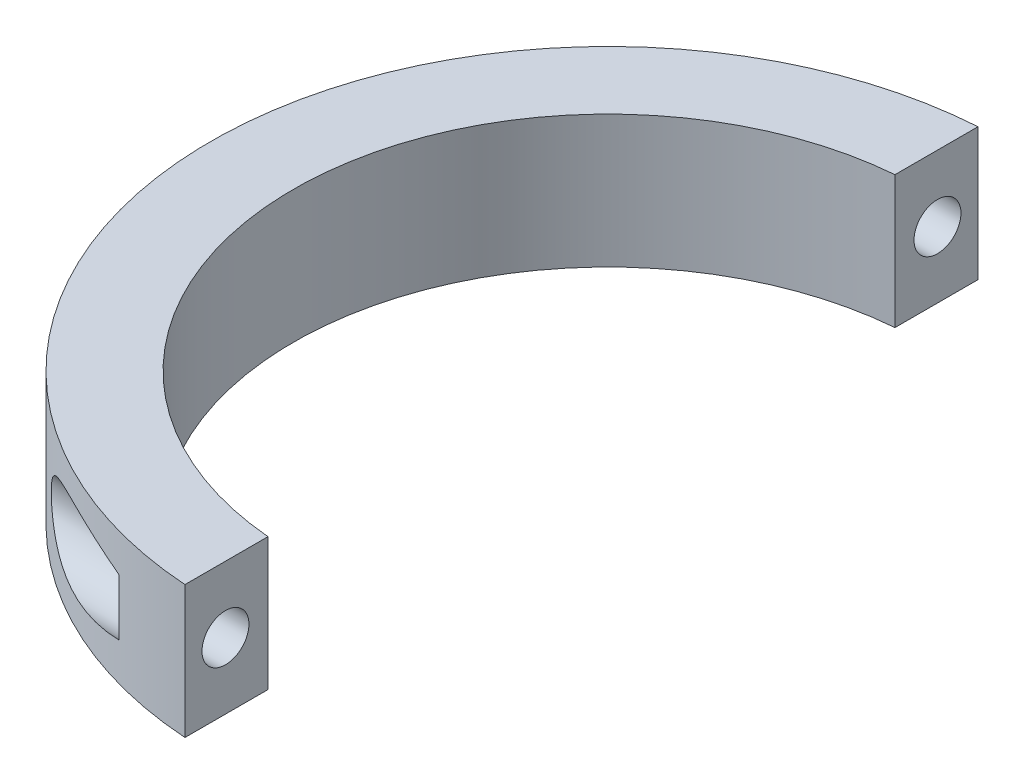
ISO-10303-21;
HEADER;
FILE_DESCRIPTION(('STEP AP214'),'2;1');
FILE_NAME('part.step','',(''),(''),'','','');
FILE_SCHEMA(('AUTOMOTIVE_DESIGN { 1 0 10303 214 1 1 1 1 }'));
ENDSEC;
DATA;
#1=APPLICATION_CONTEXT('core data for automotive mechanical design processes');
#2=APPLICATION_PROTOCOL_DEFINITION('international standard','automotive_design',2000,#1);
#3=PRODUCT_CONTEXT('',#1,'mechanical');
#4=PRODUCT('Part','Part','',(#3));
#5=PRODUCT_RELATED_PRODUCT_CATEGORY('part','',(#4));
#6=PRODUCT_DEFINITION_FORMATION('','',#4);
#7=PRODUCT_DEFINITION_CONTEXT('part definition',#1,'design');
#8=PRODUCT_DEFINITION('design','',#6,#7);
#9=PRODUCT_DEFINITION_SHAPE('','',#8);
#10=(LENGTH_UNIT() NAMED_UNIT(*) SI_UNIT(.MILLI.,.METRE.));
#11=(NAMED_UNIT(*) PLANE_ANGLE_UNIT() SI_UNIT($,.RADIAN.));
#12=(NAMED_UNIT(*) SI_UNIT($,.STERADIAN.) SOLID_ANGLE_UNIT());
#13=UNCERTAINTY_MEASURE_WITH_UNIT(LENGTH_MEASURE(1.E-05),#10,'distance_accuracy_value','');
#14=(GEOMETRIC_REPRESENTATION_CONTEXT(3) GLOBAL_UNCERTAINTY_ASSIGNED_CONTEXT((#13)) GLOBAL_UNIT_ASSIGNED_CONTEXT((#10,
#11,#12)) REPRESENTATION_CONTEXT('',''));
#15=CARTESIAN_POINT('',(0.,0.,0.));
#16=DIRECTION('',(0.,0.,1.));
#17=DIRECTION('',(1.,0.,0.));
#18=AXIS2_PLACEMENT_3D('',#15,#16,#17);
#19=CARTESIAN_POINT('',(0.,12.7,0.));
#20=DIRECTION('',(0.,-1.,0.));
#21=DIRECTION('',(0.,0.,-1.));
#22=AXIS2_PLACEMENT_3D('',#19,#20,#21);
#23=CYLINDRICAL_SURFACE('',#22,38.1);
#24=DIRECTION('',(0.,-1.,0.));
#25=VECTOR('',#24,1.);
#26=CARTESIAN_POINT('',(-10.16,12.7,-36.7203540287944));
#27=LINE('',#26,#25);
#28=CARTESIAN_POINT('',(-10.16,3.63724488239715,-36.7203540287944));
#29=VERTEX_POINT('',#28);
#30=CARTESIAN_POINT('',(-10.16,9.06275511760285,-36.7203540287944));
#31=VERTEX_POINT('',#30);
#32=EDGE_CURVE('E128',#29,#31,#27,.F.);
#33=ORIENTED_EDGE('',*,*,#32,.T.);
#34=CARTESIAN_POINT('',(-10.16,9.06275511760285,-36.7203540287944));
#35=CARTESIAN_POINT('',(-10.4498793782844,9.139266832435,-36.6401502652173));
#36=CARTESIAN_POINT('',(-10.7396139369994,9.21254621262909,-36.5562878018174));
#37=CARTESIAN_POINT('',(-11.3185881930602,9.35214297975926,-36.3811903474877));
#38=CARTESIAN_POINT('',(-11.6078277945083,9.41845914113627,-36.2899540637154));
#39=CARTESIAN_POINT('',(-12.1867340149477,9.54387117896103,-36.0996779980814));
#40=CARTESIAN_POINT('',(-12.4763972132011,9.60293512858618,-36.0006066606913));
#41=CARTESIAN_POINT('',(-13.0546328915229,9.7127497906084,-35.7949816563714));
#42=CARTESIAN_POINT('',(-13.3432054227741,9.76350089796286,-35.6884283452668));
#43=CARTESIAN_POINT('',(-13.9302715862553,9.8575682305049,-35.4635048523529));
#44=CARTESIAN_POINT('',(-14.22871028404,9.90051465439778,-35.3448350718436));
#45=CARTESIAN_POINT('',(-14.8236836425761,9.97512326774885,-35.0994578633115));
#46=CARTESIAN_POINT('',(-15.1202184201628,10.0067861562546,-34.9727509337864));
#47=CARTESIAN_POINT('',(-15.7103930498755,10.0571968325371,-34.7116332331982));
#48=CARTESIAN_POINT('',(-16.0040370254408,10.075966887296,-34.5772361808429));
#49=CARTESIAN_POINT('',(-16.5882320394184,10.0987313712822,-34.3008009370676));
#50=CARTESIAN_POINT('',(-16.8787838260417,10.1027294598165,-34.1587646468836));
#51=CARTESIAN_POINT('',(-17.4517807103688,10.0936139323466,-33.869555645988));
#52=CARTESIAN_POINT('',(-17.7342822224076,10.0807497062934,-33.7224884282365));
#53=CARTESIAN_POINT('',(-18.2944530966177,10.035438582895,-33.4219099332835));
#54=CARTESIAN_POINT('',(-18.5721203882095,10.0029834969076,-33.2683959864388));
#55=CARTESIAN_POINT('',(-19.1180704238911,9.91524817020202,-32.9576527417508));
#56=CARTESIAN_POINT('',(-19.3864202270568,9.8602055510788,-32.8004777290178));
#57=CARTESIAN_POINT('',(-19.7819761844964,9.75712797225817,-32.5623580094108));
#58=CARTESIAN_POINT('',(-19.9126210233151,9.7193670845619,-32.4826209742536));
#59=CARTESIAN_POINT('',(-20.1711868511264,9.63629553314206,-32.3226901221327));
#60=CARTESIAN_POINT('',(-20.2991084856813,9.59098668173011,-32.2424964192711));
#61=CARTESIAN_POINT('',(-20.5227404664535,9.50336669350199,-32.1004738540825));
#62=CARTESIAN_POINT('',(-20.6191141692574,9.46274827698655,-32.0386481462057));
#63=CARTESIAN_POINT('',(-20.8095714330989,9.37615609314112,-31.91527283802));
#64=CARTESIAN_POINT('',(-20.90365517573,9.33018275213941,-31.8537232161354));
#65=CARTESIAN_POINT('',(-21.1823337650701,9.1833471764062,-31.6696720663653));
#66=CARTESIAN_POINT('',(-21.363046976953,9.07368674635615,-31.5479649125246));
#67=CARTESIAN_POINT('',(-21.6236035863352,8.88816438921664,-31.3694292488962));
#68=CARTESIAN_POINT('',(-21.7091209324604,8.82242004862524,-31.3102909672607));
#69=CARTESIAN_POINT('',(-21.8754771617314,8.68344967622131,-31.1942913365935));
#70=CARTESIAN_POINT('',(-21.956315216895,8.61022232662038,-31.1374303910724));
#71=CARTESIAN_POINT('',(-22.1899858044602,8.37880788677412,-30.9717698875452));
#72=CARTESIAN_POINT('',(-22.3346522796574,8.20842485733006,-30.8674259741624));
#73=CARTESIAN_POINT('',(-22.5417096042825,7.90482877147433,-30.7163014748471));
#74=CARTESIAN_POINT('',(-22.6144908965921,7.78204247429849,-30.6627018712882));
#75=CARTESIAN_POINT('',(-22.7436518484839,7.52372751391864,-30.5670203782202));
#76=CARTESIAN_POINT('',(-22.8000416445771,7.38820679460418,-30.5249313715082));
#77=CARTESIAN_POINT('',(-22.8696961731287,7.17655236750164,-30.4727395420017));
#78=CARTESIAN_POINT('',(-22.8904994925048,7.10417738641295,-30.457109868252));
#79=CARTESIAN_POINT('',(-22.9265245209144,6.95730713232479,-30.4300013340294));
#80=CARTESIAN_POINT('',(-22.941749210924,6.88281301470098,-30.4185202567733));
#81=CARTESIAN_POINT('',(-22.9662543525393,6.73234195248588,-30.4000230405822));
#82=CARTESIAN_POINT('',(-22.9755380946557,6.65636585279226,-30.3930044300363));
#83=CARTESIAN_POINT('',(-22.9879508807,6.50365391374477,-30.3836167430796));
#84=CARTESIAN_POINT('',(-22.9910808022017,6.42691818428778,-30.3812470037105));
#85=CARTESIAN_POINT('',(-22.9910719969008,6.21713445312635,-30.381255198153));
#86=CARTESIAN_POINT('',(-22.981663093645,6.08400564388716,-30.3883815533356));
#87=CARTESIAN_POINT('',(-22.9447254713606,5.82186485272825,-30.416279728128));
#88=CARTESIAN_POINT('',(-22.9171938596606,5.69285353147218,-30.4370537261169));
#89=CARTESIAN_POINT('',(-22.8465646545525,5.44421931964253,-30.4901028482784));
#90=CARTESIAN_POINT('',(-22.8037413229643,5.32447360115312,-30.522175204246));
#91=CARTESIAN_POINT('',(-22.7048181928975,5.09380625491708,-30.5958336867242));
#92=CARTESIAN_POINT('',(-22.6487135754482,4.98288784963034,-30.6374232662735));
#93=CARTESIAN_POINT('',(-22.4904731533585,4.71022666368324,-30.7539085591815));
#94=CARTESIAN_POINT('',(-22.3803118980676,4.55548351701197,-30.834288955918));
#95=CARTESIAN_POINT('',(-22.1405394368081,4.26935401509501,-31.0069092596295));
#96=CARTESIAN_POINT('',(-22.0108757481281,4.13803284090422,-31.0991810684344));
#97=CARTESIAN_POINT('',(-21.7667035341688,3.92250601169395,-31.2704009252537));
#98=CARTESIAN_POINT('',(-21.654803572308,3.83421264593135,-31.3480305284652));
#99=CARTESIAN_POINT('',(-21.4242137965044,3.66970789148654,-31.506072460402));
#100=CARTESIAN_POINT('',(-21.3055199751297,3.59350373581099,-31.5864864202299));
#101=CARTESIAN_POINT('',(-21.0626933970975,3.45195735553614,-31.7489262309145));
#102=CARTESIAN_POINT('',(-20.9385546233013,3.38662755067597,-31.8309538068057));
#103=CARTESIAN_POINT('',(-20.6859768813759,3.26580805612975,-31.9956736855254));
#104=CARTESIAN_POINT('',(-20.5575363512587,3.21032198782636,-32.0783662213374));
#105=CARTESIAN_POINT('',(-20.1957152616478,3.06840569055995,-32.3081756891489));
#106=CARTESIAN_POINT('',(-19.958551415534,2.99155402057319,-32.4552831042554));
#107=CARTESIAN_POINT('',(-19.4763297039243,2.86120440370837,-32.746941945267));
#108=CARTESIAN_POINT('',(-19.231265794447,2.80772481602137,-32.8914912765434));
#109=CARTESIAN_POINT('',(-18.7348308061817,2.72043242930371,-33.1767727356861));
#110=CARTESIAN_POINT('',(-18.4834473045818,2.68666214292096,-33.3174959924364));
#111=CARTESIAN_POINT('',(-17.9763328705112,2.6360547352252,-33.5938216569218));
#112=CARTESIAN_POINT('',(-17.7206028530657,2.61921409371689,-33.7294251235731));
#113=CARTESIAN_POINT('',(-17.2200555974691,2.60064726940273,-33.987564215693));
#114=CARTESIAN_POINT('',(-16.9754236794418,2.59813163839407,-34.1104070390872));
#115=CARTESIAN_POINT('',(-16.4836624239053,2.60449970766501,-34.3507465966333));
#116=CARTESIAN_POINT('',(-16.2365326566178,2.61338540395324,-34.4682423909618));
#117=CARTESIAN_POINT('',(-15.7401036881022,2.64123357343302,-34.6977516242684));
#118=CARTESIAN_POINT('',(-15.4908030720431,2.6602031917376,-34.8097611143059));
#119=CARTESIAN_POINT('',(-14.990552390644,2.70711417792428,-35.0281008887918));
#120=CARTESIAN_POINT('',(-14.7396021399098,2.73505657170021,-35.134430522217));
#121=CARTESIAN_POINT('',(-13.9846913525916,2.83090369555443,-35.4448077806184));
#122=CARTESIAN_POINT('',(-13.478673823249,2.91082817352626,-35.6402423587148));
#123=CARTESIAN_POINT('',(-12.4634332816491,3.09679842522697,-36.0078356262959));
#124=CARTESIAN_POINT('',(-11.9542121426931,3.20283010657791,-36.1800067957117));
#125=CARTESIAN_POINT('',(-11.230036307847,3.36912989588697,-36.4080571678399));
#126=CARTESIAN_POINT('',(-11.0158877315685,3.42022527819607,-36.4734170362012));
#127=CARTESIAN_POINT('',(-10.5878554662873,3.52603922378802,-36.5999589646558));
#128=CARTESIAN_POINT('',(-10.37397241987,3.58074857335718,-36.6611508981451));
#129=CARTESIAN_POINT('',(-10.16,3.63724488239714,-36.7203540287944));
#130=B_SPLINE_CURVE_WITH_KNOTS('',3,(#34,#35,#36,#37,#38,#39,#40,#41,#42,#43,#44,#45,#46,#47,
#48,#49,#50,#51,#52,#53,#54,#55,#56,#57,#58,#59,#60,#61,#62,#63,#64,#65,#66,#67,#68,#69,#70,#71,
#72,#73,#74,#75,#76,#77,#78,#79,#80,#81,#82,#83,#84,#85,#86,#87,#88,#89,#90,#91,#92,#93,#94,#95,
#96,#97,#98,#99,#100,#101,#102,#103,#104,#105,#106,#107,#108,#109,#110,#111,#112,#113,#114,#115,
#116,#117,#118,#119,#120,#121,#122,#123,#124,#125,#126,#127,#128,#129),.UNSPECIFIED.,.F.,.F.,(4,
2,2,2,2,2,2,2,2,2,2,2,2,2,2,2,2,2,2,2,2,2,2,2,2,2,2,2,2,2,2,2,2,2,2,2,2,2,2,2,2,2,2,2,2,2,2,4),
(0.,0.931029279477802,1.8622221507502,2.79737770875714,3.73248882302647,4.70428641634394,
5.67602379352645,6.64607865194555,7.61589319255797,8.57152497014272,9.52755646221673,
10.4737782963642,10.9465496125283,11.4192075766275,11.7835428970117,12.1478492309143,
12.8776111141861,13.2463527764409,13.6151594878803,14.3499674383435,14.8059623649878,
15.2616747012519,15.4921185831406,15.722439145681,15.9526320299883,16.1827920849515,
16.5815234422557,16.9803184588404,17.3722932830806,17.7644105497282,18.3796823173032,
18.9966404810372,19.4828987925897,19.969446945421,20.4565470340766,20.9438259505932,
21.8108078341177,22.6784695287511,23.5479959042277,24.4173414409335,25.2382762004677,
26.0593546990961,26.8810157621213,27.702770802458,29.3462909278875,30.9889258368998,
31.6778434666038,32.3650678739381),.UNSPECIFIED.);
#131=EDGE_CURVE('E11',#31,#29,#130,.T.);
#132=ORIENTED_EDGE('',*,*,#131,.T.);
#133=EDGE_LOOP('',(#33,#132));
#134=FACE_BOUND('',#133,.T.);
#135=DIRECTION('',(0.,-1.,0.));
#136=VECTOR('',#135,1.);
#137=CARTESIAN_POINT('',(-10.16,12.7,36.7203540287944));
#138=LINE('',#137,#136);
#139=CARTESIAN_POINT('',(-10.16,9.06275511760284,36.7203540287944));
#140=VERTEX_POINT('',#139);
#141=CARTESIAN_POINT('',(-10.16,3.63724488239716,36.7203540287944));
#142=VERTEX_POINT('',#141);
#143=EDGE_CURVE('E121',#140,#142,#138,.T.);
#144=ORIENTED_EDGE('',*,*,#143,.T.);
#145=CARTESIAN_POINT('',(-10.16,3.63724488239715,36.7203540287944));
#146=CARTESIAN_POINT('',(-10.4498793782844,3.56073316756501,36.6401502652173));
#147=CARTESIAN_POINT('',(-10.7396139369994,3.48745378737092,36.5562878018174));
#148=CARTESIAN_POINT('',(-11.3185881930602,3.34785702024076,36.3811903474877));
#149=CARTESIAN_POINT('',(-11.6078277945083,3.28154085886375,36.2899540637154));
#150=CARTESIAN_POINT('',(-12.1867340149477,3.15612882103898,36.0996779980814));
#151=CARTESIAN_POINT('',(-12.4763972132011,3.09706487141384,36.0006066606913));
#152=CARTESIAN_POINT('',(-13.0546328915229,2.98725020939161,35.7949816563714));
#153=CARTESIAN_POINT('',(-13.3432054227741,2.93649910203715,35.6884283452668));
#154=CARTESIAN_POINT('',(-13.9302715862553,2.84243176949511,35.4635048523529));
#155=CARTESIAN_POINT('',(-14.22871028404,2.79948534560223,35.3448350718436));
#156=CARTESIAN_POINT('',(-14.8236836425761,2.72487673225116,35.0994578633115));
#157=CARTESIAN_POINT('',(-15.1202184201628,2.69321384374542,34.9727509337864));
#158=CARTESIAN_POINT('',(-15.7103930498755,2.64280316746293,34.7116332331982));
#159=CARTESIAN_POINT('',(-16.0040370254408,2.62403311270403,34.5772361808429));
#160=CARTESIAN_POINT('',(-16.5882320394184,2.60126862871779,34.3008009370676));
#161=CARTESIAN_POINT('',(-16.8787838260417,2.59727054018355,34.1587646468836));
#162=CARTESIAN_POINT('',(-17.4517807103687,2.60638606765336,33.869555645988));
#163=CARTESIAN_POINT('',(-17.7342822224076,2.61925029370657,33.7224884282365));
#164=CARTESIAN_POINT('',(-18.2944530966177,2.66456141710498,33.4219099332835));
#165=CARTESIAN_POINT('',(-18.5721203882095,2.69701650309236,33.2683959864388));
#166=CARTESIAN_POINT('',(-19.1180704238911,2.78475182979798,32.9576527417508));
#167=CARTESIAN_POINT('',(-19.3864202270568,2.83979444892121,32.8004777290178));
#168=CARTESIAN_POINT('',(-19.7819761844964,2.94287202774183,32.5623580094108));
#169=CARTESIAN_POINT('',(-19.9126210233151,2.9806329154381,32.4826209742536));
#170=CARTESIAN_POINT('',(-20.1711868511264,3.06370446685794,32.3226901221327));
#171=CARTESIAN_POINT('',(-20.2991084856813,3.10901331826989,32.2424964192711));
#172=CARTESIAN_POINT('',(-20.5227404664535,3.19663330649801,32.1004738540825));
#173=CARTESIAN_POINT('',(-20.6191141692573,3.23725172301345,32.0386481462057));
#174=CARTESIAN_POINT('',(-20.8095714330989,3.32384390685888,31.91527283802));
#175=CARTESIAN_POINT('',(-20.90365517573,3.36981724786059,31.8537232161354));
#176=CARTESIAN_POINT('',(-21.1823337650701,3.5166528235938,31.6696720663653));
#177=CARTESIAN_POINT('',(-21.363046976953,3.62631325364385,31.5479649125246));
#178=CARTESIAN_POINT('',(-21.6236035863352,3.81183561078336,31.3694292488962));
#179=CARTESIAN_POINT('',(-21.7091209324604,3.87757995137476,31.3102909672607));
#180=CARTESIAN_POINT('',(-21.8754771617314,4.0165503237787,31.1942913365934));
#181=CARTESIAN_POINT('',(-21.956315216895,4.08977767337963,31.1374303910724));
#182=CARTESIAN_POINT('',(-22.1899858044602,4.32119211322589,30.9717698875452));
#183=CARTESIAN_POINT('',(-22.3346522796574,4.49157514266995,30.8674259741624));
#184=CARTESIAN_POINT('',(-22.5417096042825,4.79517122852568,30.7163014748471));
#185=CARTESIAN_POINT('',(-22.6144908965922,4.91795752570152,30.6627018712882));
#186=CARTESIAN_POINT('',(-22.7436518484839,5.17627248608137,30.5670203782202));
#187=CARTESIAN_POINT('',(-22.8000416445771,5.31179320539583,30.5249313715082));
#188=CARTESIAN_POINT('',(-22.8696961731287,5.52344763249837,30.4727395420017));
#189=CARTESIAN_POINT('',(-22.8904994925048,5.59582261358706,30.457109868252));
#190=CARTESIAN_POINT('',(-22.9265245209144,5.74269286767521,30.4300013340294));
#191=CARTESIAN_POINT('',(-22.941749210924,5.81718698529903,30.4185202567733));
#192=CARTESIAN_POINT('',(-22.9662543525393,5.96765804751413,30.4000230405822));
#193=CARTESIAN_POINT('',(-22.9755380946557,6.04363414720775,30.3930044300363));
#194=CARTESIAN_POINT('',(-22.9879508807,6.19634608625523,30.3836167430796));
#195=CARTESIAN_POINT('',(-22.9910808022017,6.27308181571223,30.3812470037105));
#196=CARTESIAN_POINT('',(-22.9910719969008,6.48286554687366,30.381255198153));
#197=CARTESIAN_POINT('',(-22.981663093645,6.61599435611284,30.3883815533356));
#198=CARTESIAN_POINT('',(-22.9447254713607,6.87813514727175,30.416279728128));
#199=CARTESIAN_POINT('',(-22.9171938596606,7.00714646852782,30.4370537261169));
#200=CARTESIAN_POINT('',(-22.8465646545525,7.25578068035747,30.4901028482784));
#201=CARTESIAN_POINT('',(-22.8037413229643,7.37552639884688,30.522175204246));
#202=CARTESIAN_POINT('',(-22.7048181928975,7.60619374508291,30.5958336867242));
#203=CARTESIAN_POINT('',(-22.6487135754482,7.71711215036966,30.6374232662735));
#204=CARTESIAN_POINT('',(-22.4904731533585,7.98977333631675,30.7539085591815));
#205=CARTESIAN_POINT('',(-22.3803118980676,8.14451648298803,30.834288955918));
#206=CARTESIAN_POINT('',(-22.1405394368081,8.43064598490499,31.0069092596295));
#207=CARTESIAN_POINT('',(-22.0108757481281,8.56196715909577,31.0991810684343));
#208=CARTESIAN_POINT('',(-21.7667035341688,8.77749398830604,31.2704009252537));
#209=CARTESIAN_POINT('',(-21.654803572308,8.86578735406864,31.3480305284651));
#210=CARTESIAN_POINT('',(-21.4242137965045,9.03029210851345,31.506072460402));
#211=CARTESIAN_POINT('',(-21.3055199751298,9.10649626418899,31.5864864202299));
#212=CARTESIAN_POINT('',(-21.0626933970975,9.24804264446385,31.7489262309145));
#213=CARTESIAN_POINT('',(-20.9385546233013,9.31337244932402,31.8309538068057));
#214=CARTESIAN_POINT('',(-20.6859768813759,9.43419194387025,31.9956736855254));
#215=CARTESIAN_POINT('',(-20.5575363512587,9.48967801217363,32.0783662213374));
#216=CARTESIAN_POINT('',(-20.1957152616479,9.63159430944003,32.3081756891489));
#217=CARTESIAN_POINT('',(-19.9585514155341,9.7084459794268,32.4552831042554));
#218=CARTESIAN_POINT('',(-19.4763297039243,9.83879559629162,32.746941945267));
#219=CARTESIAN_POINT('',(-19.231265794447,9.89227518397862,32.8914912765434));
#220=CARTESIAN_POINT('',(-18.7348308061817,9.97956757069628,33.1767727356861));
#221=CARTESIAN_POINT('',(-18.4834473045818,10.013337857079,33.3174959924364));
#222=CARTESIAN_POINT('',(-17.9763328705113,10.0639452647748,33.5938216569218));
#223=CARTESIAN_POINT('',(-17.7206028530658,10.0807859062831,33.7294251235731));
#224=CARTESIAN_POINT('',(-17.2200555974691,10.0993527305973,33.987564215693));
#225=CARTESIAN_POINT('',(-16.9754236794418,10.1018683616059,34.1104070390872));
#226=CARTESIAN_POINT('',(-16.4836624239054,10.095500292335,34.3507465966332));
#227=CARTESIAN_POINT('',(-16.2365326566178,10.0866145960468,34.4682423909617));
#228=CARTESIAN_POINT('',(-15.7401036881023,10.058766426567,34.6977516242684));
#229=CARTESIAN_POINT('',(-15.4908030720432,10.0397968082624,34.8097611143058));
#230=CARTESIAN_POINT('',(-14.9905523906441,9.99288582207572,35.0281008887918));
#231=CARTESIAN_POINT('',(-14.7396021399099,9.96494342829979,35.134430522217));
#232=CARTESIAN_POINT('',(-13.9846913525916,9.86909630444557,35.4448077806183));
#233=CARTESIAN_POINT('',(-13.4786738232491,9.78917182647374,35.6402423587148));
#234=CARTESIAN_POINT('',(-12.4634332816492,9.60320157477303,36.0078356262959));
#235=CARTESIAN_POINT('',(-11.9542121426931,9.49716989342209,36.1800067957117));
#236=CARTESIAN_POINT('',(-11.2300363078471,9.33087010411303,36.4080571678399));
#237=CARTESIAN_POINT('',(-11.0158877315685,9.27977472180393,36.4734170362012));
#238=CARTESIAN_POINT('',(-10.5878554662873,9.17396077621198,36.5999589646558));
#239=CARTESIAN_POINT('',(-10.37397241987,9.11925142664282,36.6611508981451));
#240=CARTESIAN_POINT('',(-10.16,9.06275511760284,36.7203540287944));
#241=B_SPLINE_CURVE_WITH_KNOTS('',3,(#145,#146,#147,#148,#149,#150,#151,#152,#153,#154,#155,
#156,#157,#158,#159,#160,#161,#162,#163,#164,#165,#166,#167,#168,#169,#170,#171,#172,#173,#174,
#175,#176,#177,#178,#179,#180,#181,#182,#183,#184,#185,#186,#187,#188,#189,#190,#191,#192,#193,
#194,#195,#196,#197,#198,#199,#200,#201,#202,#203,#204,#205,#206,#207,#208,#209,#210,#211,#212,
#213,#214,#215,#216,#217,#218,#219,#220,#221,#222,#223,#224,#225,#226,#227,#228,#229,#230,#231,
#232,#233,#234,#235,#236,#237,#238,#239,#240),.UNSPECIFIED.,.F.,.F.,(4,2,2,2,2,2,2,2,2,2,2,2,2,
2,2,2,2,2,2,2,2,2,2,2,2,2,2,2,2,2,2,2,2,2,2,2,2,2,2,2,2,2,2,2,2,2,2,4),(0.,0.931029279477798,
1.86222215075019,2.79737770875713,3.73248882302645,4.70428641634392,5.67602379352644,
6.64607865194554,7.61589319255796,8.5715249701427,9.52755646221671,10.4737782963642,
10.9465496125283,11.4192075766275,11.7835428970117,12.1478492309143,12.8776111141861,
13.2463527764409,13.6151594878803,14.3499674383435,14.8059623649878,15.2616747012519,
15.4921185831406,15.722439145681,15.9526320299883,16.1827920849514,16.5815234422557,
16.9803184588404,17.3722932830806,17.7644105497282,18.3796823173032,18.9966404810372,
19.4828987925897,19.969446945421,20.4565470340766,20.9438259505932,21.8108078341176,
22.6784695287511,23.5479959042276,24.4173414409334,25.2382762004676,26.059354699096,
26.8810157621212,27.7027708024579,29.3462909278874,30.9889258368997,31.6778434666037,
32.3650678739381),.UNSPECIFIED.);
#242=EDGE_CURVE('E49',#142,#140,#241,.T.);
#243=ORIENTED_EDGE('',*,*,#242,.T.);
#244=EDGE_LOOP('',(#144,#243));
#245=FACE_BOUND('',#244,.T.);
#246=CARTESIAN_POINT('',(0.,12.7,0.));
#247=DIRECTION('',(0.,1.,0.));
#248=DIRECTION('',(0.,0.,1.));
#249=AXIS2_PLACEMENT_3D('',#246,#247,#248);
#250=CIRCLE('',#249,38.1);
#251=CARTESIAN_POINT('',(-2.54,12.7,-38.0152390496232));
#252=VERTEX_POINT('',#251);
#253=CARTESIAN_POINT('',(-2.53999999999999,12.7,38.0152390496232));
#254=VERTEX_POINT('',#253);
#255=EDGE_CURVE('E108',#252,#254,#250,.T.);
#256=ORIENTED_EDGE('',*,*,#255,.F.);
#257=DIRECTION('',(0.,-1.,0.));
#258=VECTOR('',#257,1.);
#259=CARTESIAN_POINT('',(-2.54,12.7,-38.0152390496232));
#260=LINE('',#259,#258);
#261=CARTESIAN_POINT('',(-2.54,0.,-38.0152390496232));
#262=VERTEX_POINT('',#261);
#263=EDGE_CURVE('E92',#252,#262,#260,.T.);
#264=ORIENTED_EDGE('',*,*,#263,.T.);
#265=CARTESIAN_POINT('',(0.,0.,0.));
#266=DIRECTION('',(0.,1.,0.));
#267=DIRECTION('',(0.,0.,1.));
#268=AXIS2_PLACEMENT_3D('',#265,#266,#267);
#269=CIRCLE('',#268,38.1);
#270=CARTESIAN_POINT('',(-2.53999999999999,0.,38.0152390496232));
#271=VERTEX_POINT('',#270);
#272=EDGE_CURVE('E118',#262,#271,#269,.T.);
#273=ORIENTED_EDGE('',*,*,#272,.T.);
#274=DIRECTION('',(0.,-1.,0.));
#275=VECTOR('',#274,1.);
#276=CARTESIAN_POINT('',(-2.53999999999999,12.7,38.0152390496232));
#277=LINE('',#276,#275);
#278=EDGE_CURVE('E56',#271,#254,#277,.F.);
#279=ORIENTED_EDGE('',*,*,#278,.T.);
#280=EDGE_LOOP('',(#256,#264,#273,#279));
#281=FACE_BOUND('',#280,.T.);
#282=ADVANCED_FACE('F40',(#134,#245,#281),#23,.T.);
#283=CARTESIAN_POINT('',(0.,12.7,0.));
#284=DIRECTION('',(0.,-1.,0.));
#285=DIRECTION('',(0.,0.,-1.));
#286=AXIS2_PLACEMENT_3D('',#283,#284,#285);
#287=CYLINDRICAL_SURFACE('',#286,30.1625);
#288=DIRECTION('',(0.,-1.,0.));
#289=VECTOR('',#288,1.);
#290=CARTESIAN_POINT('',(-2.53999999999999,12.7,-30.0553623543287));
#291=LINE('',#290,#289);
#292=CARTESIAN_POINT('',(-2.53999999999999,12.7,-30.0553623543287));
#293=VERTEX_POINT('',#292);
#294=CARTESIAN_POINT('',(-2.53999999999999,0.,-30.0553623543287));
#295=VERTEX_POINT('',#294);
#296=EDGE_CURVE('E64',#293,#295,#291,.T.);
#297=ORIENTED_EDGE('',*,*,#296,.F.);
#298=CARTESIAN_POINT('',(0.,12.7,0.));
#299=DIRECTION('',(0.,1.,0.));
#300=DIRECTION('',(0.,0.,1.));
#301=AXIS2_PLACEMENT_3D('',#298,#299,#300);
#302=CIRCLE('',#301,30.1625);
#303=CARTESIAN_POINT('',(-2.53999999999999,12.7,30.0553623543287));
#304=VERTEX_POINT('',#303);
#305=EDGE_CURVE('E110',#293,#304,#302,.T.);
#306=ORIENTED_EDGE('',*,*,#305,.T.);
#307=DIRECTION('',(0.,-1.,0.));
#308=VECTOR('',#307,1.);
#309=CARTESIAN_POINT('',(-2.53999999999999,12.7,30.0553623543287));
#310=LINE('',#309,#308);
#311=CARTESIAN_POINT('',(-2.53999999999999,0.,30.0553623543287));
#312=VERTEX_POINT('',#311);
#313=EDGE_CURVE('E175',#312,#304,#310,.F.);
#314=ORIENTED_EDGE('',*,*,#313,.F.);
#315=CARTESIAN_POINT('',(0.,0.,0.));
#316=DIRECTION('',(0.,1.,0.));
#317=DIRECTION('',(0.,0.,1.));
#318=AXIS2_PLACEMENT_3D('',#315,#316,#317);
#319=CIRCLE('',#318,30.1625);
#320=EDGE_CURVE('E114',#295,#312,#319,.T.);
#321=ORIENTED_EDGE('',*,*,#320,.F.);
#322=EDGE_LOOP('',(#297,#306,#314,#321));
#323=FACE_BOUND('',#322,.T.);
#324=ADVANCED_FACE('F164',(#323),#287,.F.);
#325=CARTESIAN_POINT('',(0.,12.7,0.));
#326=DIRECTION('',(0.,1.,0.));
#327=DIRECTION('',(0.,0.,1.));
#328=AXIS2_PLACEMENT_3D('',#325,#326,#327);
#329=PLANE('',#328);
#330=DIRECTION('',(0.,0.,1.));
#331=VECTOR('',#330,1.);
#332=CARTESIAN_POINT('',(-2.54,12.7,-38.1));
#333=LINE('',#332,#331);
#334=EDGE_CURVE('E95',#252,#293,#333,.T.);
#335=ORIENTED_EDGE('',*,*,#334,.F.);
#336=ORIENTED_EDGE('',*,*,#255,.T.);
#337=EDGE_CURVE('E112',#304,#254,#333,.T.);
#338=ORIENTED_EDGE('',*,*,#337,.F.);
#339=ORIENTED_EDGE('',*,*,#305,.F.);
#340=EDGE_LOOP('',(#335,#336,#338,#339));
#341=FACE_BOUND('',#340,.T.);
#342=ADVANCED_FACE('F106',(#341),#329,.T.);
#343=CARTESIAN_POINT('',(0.,0.,0.));
#344=DIRECTION('',(0.,1.,0.));
#345=DIRECTION('',(0.,0.,1.));
#346=AXIS2_PLACEMENT_3D('',#343,#344,#345);
#347=PLANE('',#346);
#348=ORIENTED_EDGE('',*,*,#272,.F.);
#349=DIRECTION('',(0.,0.,1.));
#350=VECTOR('',#349,1.);
#351=CARTESIAN_POINT('',(-2.54,0.,-38.1));
#352=LINE('',#351,#350);
#353=EDGE_CURVE('E96',#262,#295,#352,.T.);
#354=ORIENTED_EDGE('',*,*,#353,.T.);
#355=ORIENTED_EDGE('',*,*,#320,.T.);
#356=EDGE_CURVE('E111',#312,#271,#352,.T.);
#357=ORIENTED_EDGE('',*,*,#356,.T.);
#358=EDGE_LOOP('',(#348,#354,#355,#357));
#359=FACE_BOUND('',#358,.T.);
#360=ADVANCED_FACE('F156',(#359),#347,.F.);
#361=CARTESIAN_POINT('',(-38.1,6.35,34.13125));
#362=DIRECTION('',(1.,0.,0.));
#363=DIRECTION('',(0.,0.,-1.));
#364=AXIS2_PLACEMENT_3D('',#361,#362,#363);
#365=CYLINDRICAL_SURFACE('',#364,2.25);
#366=CARTESIAN_POINT('',(-2.53999999999999,6.35,34.13125));
#367=DIRECTION('',(-1.,0.,0.));
#368=DIRECTION('',(0.,0.,1.));
#369=AXIS2_PLACEMENT_3D('',#366,#367,#368);
#370=CIRCLE('',#369,2.25);
#371=CARTESIAN_POINT('',(-2.53999999999999,6.35,36.38125));
#372=VERTEX_POINT('',#371);
#373=EDGE_CURVE('E178',#372,#372,#370,.F.);
#374=ORIENTED_EDGE('',*,*,#373,.T.);
#375=EDGE_LOOP('',(#374));
#376=FACE_BOUND('',#375,.T.);
#377=CARTESIAN_POINT('',(-10.16,6.35,34.13125));
#378=DIRECTION('',(1.,0.,0.));
#379=DIRECTION('',(0.,0.,-1.));
#380=AXIS2_PLACEMENT_3D('',#377,#378,#379);
#381=CIRCLE('',#380,2.25);
#382=CARTESIAN_POINT('',(-10.16,6.35,31.88125));
#383=VERTEX_POINT('',#382);
#384=EDGE_CURVE('E130',#383,#383,#381,.F.);
#385=ORIENTED_EDGE('',*,*,#384,.T.);
#386=EDGE_LOOP('',(#385));
#387=FACE_BOUND('',#386,.T.);
#388=ADVANCED_FACE('F152',(#376,#387),#365,.F.);
#389=CARTESIAN_POINT('',(-38.1,6.35,-34.13125));
#390=DIRECTION('',(1.,0.,0.));
#391=DIRECTION('',(0.,0.,-1.));
#392=AXIS2_PLACEMENT_3D('',#389,#390,#391);
#393=CYLINDRICAL_SURFACE('',#392,2.25);
#394=CARTESIAN_POINT('',(-2.53999999999999,6.35,-34.13125));
#395=DIRECTION('',(-1.,0.,0.));
#396=DIRECTION('',(0.,0.,1.));
#397=AXIS2_PLACEMENT_3D('',#394,#395,#396);
#398=CIRCLE('',#397,2.25);
#399=CARTESIAN_POINT('',(-2.53999999999999,6.35,-31.88125));
#400=VERTEX_POINT('',#399);
#401=EDGE_CURVE('E44',#400,#400,#398,.F.);
#402=ORIENTED_EDGE('',*,*,#401,.T.);
#403=EDGE_LOOP('',(#402));
#404=FACE_BOUND('',#403,.T.);
#405=CARTESIAN_POINT('',(-10.16,6.35,-34.13125));
#406=DIRECTION('',(1.,0.,0.));
#407=DIRECTION('',(0.,0.,-1.));
#408=AXIS2_PLACEMENT_3D('',#405,#406,#407);
#409=CIRCLE('',#408,2.25);
#410=CARTESIAN_POINT('',(-10.16,6.35,-36.38125));
#411=VERTEX_POINT('',#410);
#412=EDGE_CURVE('E125',#411,#411,#409,.F.);
#413=ORIENTED_EDGE('',*,*,#412,.T.);
#414=EDGE_LOOP('',(#413));
#415=FACE_BOUND('',#414,.T.);
#416=ADVANCED_FACE('F155',(#404,#415),#393,.F.);
#417=CARTESIAN_POINT('',(-38.1,6.35,-34.13125));
#418=DIRECTION('',(1.,0.,0.));
#419=DIRECTION('',(0.,0.,-1.));
#420=AXIS2_PLACEMENT_3D('',#417,#418,#419);
#421=CYLINDRICAL_SURFACE('',#420,3.75000000000001);
#422=CARTESIAN_POINT('',(-10.16,6.35,-34.13125));
#423=DIRECTION('',(1.,0.,0.));
#424=DIRECTION('',(0.,0.,-1.));
#425=AXIS2_PLACEMENT_3D('',#422,#423,#424);
#426=CIRCLE('',#425,3.75000000000001);
#427=EDGE_CURVE('E129',#31,#29,#426,.T.);
#428=ORIENTED_EDGE('',*,*,#427,.T.);
#429=ORIENTED_EDGE('',*,*,#131,.F.);
#430=EDGE_LOOP('',(#428,#429));
#431=FACE_BOUND('',#430,.T.);
#432=ADVANCED_FACE('F160',(#431),#421,.F.);
#433=CARTESIAN_POINT('',(-10.16,6.35,-34.13125));
#434=DIRECTION('',(1.,0.,0.));
#435=DIRECTION('',(0.,0.,-1.));
#436=AXIS2_PLACEMENT_3D('',#433,#434,#435);
#437=PLANE('',#436);
#438=ORIENTED_EDGE('',*,*,#412,.F.);
#439=EDGE_LOOP('',(#438));
#440=FACE_BOUND('',#439,.T.);
#441=ORIENTED_EDGE('',*,*,#427,.F.);
#442=ORIENTED_EDGE('',*,*,#32,.F.);
#443=EDGE_LOOP('',(#441,#442));
#444=FACE_BOUND('',#443,.T.);
#445=ADVANCED_FACE('F150',(#440,#444),#437,.F.);
#446=CARTESIAN_POINT('',(-38.1,6.35,34.13125));
#447=DIRECTION('',(1.,0.,0.));
#448=DIRECTION('',(0.,0.,-1.));
#449=AXIS2_PLACEMENT_3D('',#446,#447,#448);
#450=CYLINDRICAL_SURFACE('',#449,3.75);
#451=CARTESIAN_POINT('',(-10.16,6.35,34.13125));
#452=DIRECTION('',(1.,0.,0.));
#453=DIRECTION('',(0.,0.,-1.));
#454=AXIS2_PLACEMENT_3D('',#451,#452,#453);
#455=CIRCLE('',#454,3.75);
#456=EDGE_CURVE('E101',#142,#140,#455,.T.);
#457=ORIENTED_EDGE('',*,*,#456,.T.);
#458=ORIENTED_EDGE('',*,*,#242,.F.);
#459=EDGE_LOOP('',(#457,#458));
#460=FACE_BOUND('',#459,.T.);
#461=ADVANCED_FACE('F144',(#460),#450,.F.);
#462=CARTESIAN_POINT('',(-10.16,6.35,34.13125));
#463=DIRECTION('',(1.,0.,0.));
#464=DIRECTION('',(0.,0.,-1.));
#465=AXIS2_PLACEMENT_3D('',#462,#463,#464);
#466=PLANE('',#465);
#467=ORIENTED_EDGE('',*,*,#384,.F.);
#468=EDGE_LOOP('',(#467));
#469=FACE_BOUND('',#468,.T.);
#470=ORIENTED_EDGE('',*,*,#456,.F.);
#471=ORIENTED_EDGE('',*,*,#143,.F.);
#472=EDGE_LOOP('',(#470,#471));
#473=FACE_BOUND('',#472,.T.);
#474=ADVANCED_FACE('F149',(#469,#473),#466,.F.);
#475=CARTESIAN_POINT('',(-2.54,0.,-38.1));
#476=DIRECTION('',(-1.,0.,0.));
#477=DIRECTION('',(0.,0.,1.));
#478=AXIS2_PLACEMENT_3D('',#475,#476,#477);
#479=PLANE('',#478);
#480=ORIENTED_EDGE('',*,*,#401,.F.);
#481=EDGE_LOOP('',(#480));
#482=FACE_BOUND('',#481,.T.);
#483=ORIENTED_EDGE('',*,*,#334,.T.);
#484=ORIENTED_EDGE('',*,*,#296,.T.);
#485=ORIENTED_EDGE('',*,*,#353,.F.);
#486=ORIENTED_EDGE('',*,*,#263,.F.);
#487=EDGE_LOOP('',(#483,#484,#485,#486));
#488=FACE_BOUND('',#487,.T.);
#489=ADVANCED_FACE('F94',(#482,#488),#479,.F.);
#490=ORIENTED_EDGE('',*,*,#373,.F.);
#491=EDGE_LOOP('',(#490));
#492=FACE_BOUND('',#491,.T.);
#493=ORIENTED_EDGE('',*,*,#356,.F.);
#494=ORIENTED_EDGE('',*,*,#313,.T.);
#495=ORIENTED_EDGE('',*,*,#337,.T.);
#496=ORIENTED_EDGE('',*,*,#278,.F.);
#497=EDGE_LOOP('',(#493,#494,#495,#496));
#498=FACE_BOUND('',#497,.T.);
#499=ADVANCED_FACE('F199',(#492,#498),#479,.F.);
#500=CLOSED_SHELL('',(#282,#324,#342,#360,#388,#416,#432,#445,#461,#474,#489,#499));
#501=MANIFOLD_SOLID_BREP('B2',#500);
#502=ADVANCED_BREP_SHAPE_REPRESENTATION('',(#18,#501),#14);
#503=SHAPE_DEFINITION_REPRESENTATION(#9,#502);
ENDSEC;
END-ISO-10303-21;
